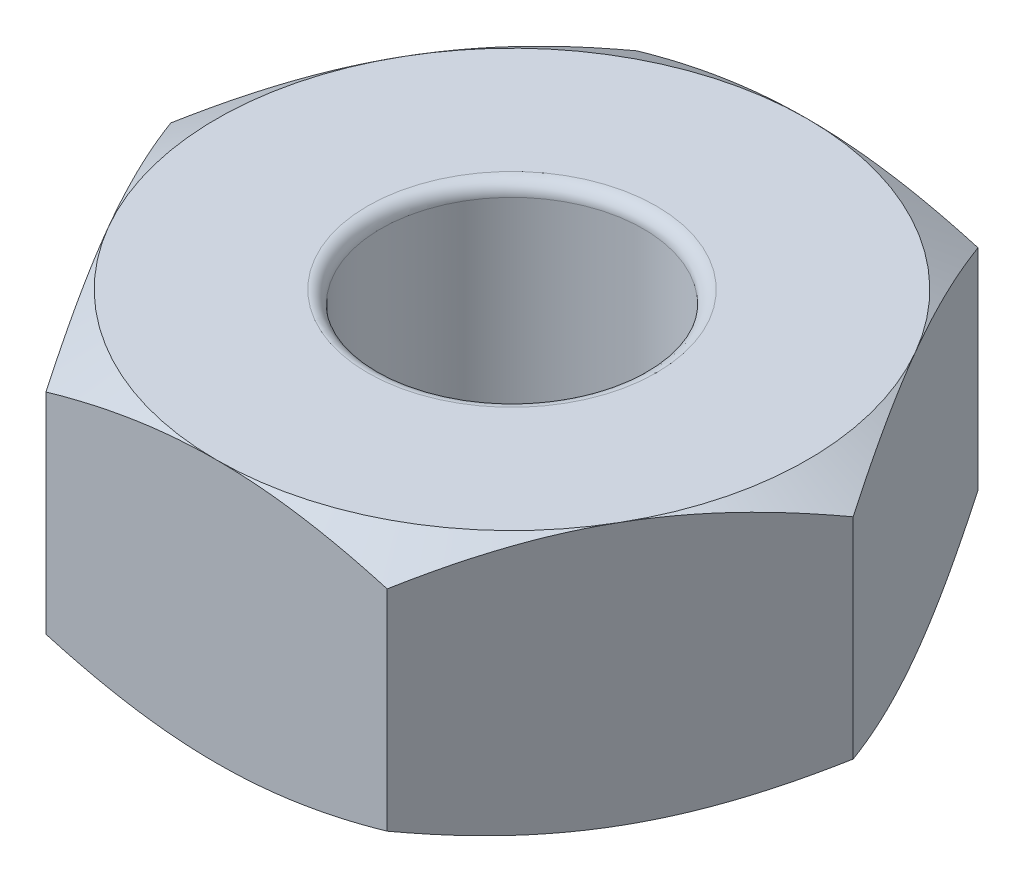
ISO-10303-21;
HEADER;
FILE_DESCRIPTION(('STEP AP214'),'2;1');
FILE_NAME('part.step','',(''),(''),'','','');
FILE_SCHEMA(('AUTOMOTIVE_DESIGN { 1 0 10303 214 1 1 1 1 }'));
ENDSEC;
DATA;
#1=APPLICATION_CONTEXT('core data for automotive mechanical design processes');
#2=APPLICATION_PROTOCOL_DEFINITION('international standard','automotive_design',2000,#1);
#3=PRODUCT_CONTEXT('',#1,'mechanical');
#4=PRODUCT('Part','Part','',(#3));
#5=PRODUCT_RELATED_PRODUCT_CATEGORY('part','',(#4));
#6=PRODUCT_DEFINITION_FORMATION('','',#4);
#7=PRODUCT_DEFINITION_CONTEXT('part definition',#1,'design');
#8=PRODUCT_DEFINITION('design','',#6,#7);
#9=PRODUCT_DEFINITION_SHAPE('','',#8);
#10=(LENGTH_UNIT() NAMED_UNIT(*) SI_UNIT(.MILLI.,.METRE.));
#11=(NAMED_UNIT(*) PLANE_ANGLE_UNIT() SI_UNIT($,.RADIAN.));
#12=(NAMED_UNIT(*) SI_UNIT($,.STERADIAN.) SOLID_ANGLE_UNIT());
#13=UNCERTAINTY_MEASURE_WITH_UNIT(LENGTH_MEASURE(1.E-05),#10,'distance_accuracy_value','');
#14=(GEOMETRIC_REPRESENTATION_CONTEXT(3) GLOBAL_UNCERTAINTY_ASSIGNED_CONTEXT((#13)) GLOBAL_UNIT_ASSIGNED_CONTEXT((#10,
#11,#12)) REPRESENTATION_CONTEXT('',''));
#15=CARTESIAN_POINT('',(0.,0.,0.));
#16=DIRECTION('',(0.,0.,1.));
#17=DIRECTION('',(1.,0.,0.));
#18=AXIS2_PLACEMENT_3D('',#15,#16,#17);
#19=CARTESIAN_POINT('',(0.,2.,0.));
#20=DIRECTION('',(0.,1.,0.));
#21=DIRECTION('',(0.,0.,1.));
#22=AXIS2_PLACEMENT_3D('',#19,#20,#21);
#23=PLANE('',#22);
#24=CARTESIAN_POINT('',(0.,2.,0.));
#25=DIRECTION('',(0.,1.,0.));
#26=DIRECTION('',(0.,0.,1.));
#27=AXIS2_PLACEMENT_3D('',#24,#25,#26);
#28=CIRCLE('',#27,1.1);
#29=CARTESIAN_POINT('',(0.,2.,1.1));
#30=VERTEX_POINT('',#29);
#31=EDGE_CURVE('E12',#30,#30,#28,.F.);
#32=ORIENTED_EDGE('',*,*,#31,.T.);
#33=EDGE_LOOP('',(#32));
#34=FACE_BOUND('',#33,.T.);
#35=CARTESIAN_POINT('',(0.,2.,0.));
#36=DIRECTION('',(0.,1.,0.));
#37=DIRECTION('',(0.,0.,1.));
#38=AXIS2_PLACEMENT_3D('',#35,#36,#37);
#39=CIRCLE('',#38,2.25);
#40=CARTESIAN_POINT('',(-1.94855715851499,2.,1.125));
#41=VERTEX_POINT('',#40);
#42=CARTESIAN_POINT('',(0.,2.,2.25));
#43=VERTEX_POINT('',#42);
#44=EDGE_CURVE('E165',#41,#43,#39,.T.);
#45=ORIENTED_EDGE('',*,*,#44,.T.);
#46=CARTESIAN_POINT('',(1.94855715851499,2.,1.125));
#47=VERTEX_POINT('',#46);
#48=EDGE_CURVE('E144',#43,#47,#39,.T.);
#49=ORIENTED_EDGE('',*,*,#48,.T.);
#50=CARTESIAN_POINT('',(1.94855715851499,2.,-1.125));
#51=VERTEX_POINT('',#50);
#52=EDGE_CURVE('E133',#47,#51,#39,.T.);
#53=ORIENTED_EDGE('',*,*,#52,.T.);
#54=CARTESIAN_POINT('',(0.,2.,-2.25));
#55=VERTEX_POINT('',#54);
#56=EDGE_CURVE('E59',#51,#55,#39,.T.);
#57=ORIENTED_EDGE('',*,*,#56,.T.);
#58=CARTESIAN_POINT('',(-1.94855715851499,2.,-1.125));
#59=VERTEX_POINT('',#58);
#60=EDGE_CURVE('E67',#55,#59,#39,.T.);
#61=ORIENTED_EDGE('',*,*,#60,.T.);
#62=EDGE_CURVE('E172',#59,#41,#39,.T.);
#63=ORIENTED_EDGE('',*,*,#62,.T.);
#64=EDGE_LOOP('',(#45,#49,#53,#57,#61,#63));
#65=FACE_BOUND('',#64,.T.);
#66=ADVANCED_FACE('F43',(#34,#65),#23,.T.);
#67=CARTESIAN_POINT('',(1.29903810567666,2.,2.25));
#68=DIRECTION('',(-0.866025403784439,0.,-0.5));
#69=DIRECTION('',(-0.5,0.,0.866025403784439));
#70=AXIS2_PLACEMENT_3D('',#67,#68,#69);
#71=PLANE('',#70);
#72=CARTESIAN_POINT('',(1.29892263562282,1.79897143456575,2.2502));
#73=CARTESIAN_POINT('',(1.35600944184252,1.83194442195214,2.15132275118564));
#74=CARTESIAN_POINT('',(1.41358901625738,1.8619324645844,2.05159200282091));
#75=CARTESIAN_POINT('',(1.52974527574028,1.91427761176912,1.85040345977937));
#76=CARTESIAN_POINT('',(1.58832402518513,1.93661619729352,1.74894208949705));
#77=CARTESIAN_POINT('',(1.7047555284741,1.97139044232658,1.54727681019892));
#78=CARTESIAN_POINT('',(1.76259036492223,1.98405752616628,1.44710393502333));
#79=CARTESIAN_POINT('',(1.87853225689702,1.99918109258258,1.24628668739732));
#80=CARTESIAN_POINT('',(1.93663889083104,2.001650096976,1.1456430451668));
#81=CARTESIAN_POINT('',(2.04522012232352,1.99652162536397,0.957574835473435));
#82=CARTESIAN_POINT('',(2.09571095029608,1.99018336548488,0.870122156108742));
#83=CARTESIAN_POINT('',(2.19636364908279,1.97009234281011,0.695786567891226));
#84=CARTESIAN_POINT('',(2.24652517159694,1.95633271276892,0.608904262311712));
#85=CARTESIAN_POINT('',(2.34738550181938,1.92193373464933,0.434209045898264));
#86=CARTESIAN_POINT('',(2.39807153998286,1.90114852841735,0.346418252564746));
#87=CARTESIAN_POINT('',(2.49868751999961,1.85397391263702,0.172146263122405));
#88=CARTESIAN_POINT('',(2.54861875151746,1.8275955919857,0.0856628332489973));
#89=CARTESIAN_POINT('',(2.59819168140715,1.79897143456575,-0.000200000000000289));
#90=B_SPLINE_CURVE_WITH_KNOTS('',3,(#72,#73,#74,#75,#76,#77,#78,#79,#80,#81,#82,#83,#84,#85,#86,
#87,#88,#89),.UNSPECIFIED.,.F.,.F.,(4,2,2,2,2,2,2,2,4),(0.,0.356658826016552,0.714175103224236,
1.06284241804968,1.41108149062516,1.71433394539794,2.01786749258222,2.32813511279245,
2.63779325460359),.UNSPECIFIED.);
#91=CARTESIAN_POINT('',(1.29903810567666,1.79903810567666,2.25));
#92=VERTEX_POINT('',#91);
#93=EDGE_CURVE('E149',#92,#47,#90,.T.);
#94=ORIENTED_EDGE('',*,*,#93,.F.);
#95=DIRECTION('',(0.,-1.,0.));
#96=VECTOR('',#95,1.);
#97=CARTESIAN_POINT('',(1.29903810567666,2.,2.25));
#98=LINE('',#97,#96);
#99=CARTESIAN_POINT('',(1.29903810567666,0.200961894323341,2.25));
#100=VERTEX_POINT('',#99);
#101=EDGE_CURVE('E573',#92,#100,#98,.T.);
#102=ORIENTED_EDGE('',*,*,#101,.T.);
#103=CARTESIAN_POINT('',(1.29892263562282,0.201028565434255,2.2502));
#104=CARTESIAN_POINT('',(1.35600944184252,0.168055578047864,2.15132275118564));
#105=CARTESIAN_POINT('',(1.41358901625738,0.138067535415598,2.05159200282091));
#106=CARTESIAN_POINT('',(1.52974527574028,0.0857223882308781,1.85040345977937));
#107=CARTESIAN_POINT('',(1.58832402518513,0.0633838027064787,1.74894208949705));
#108=CARTESIAN_POINT('',(1.7047555284741,0.0286095576734188,1.54727681019892));
#109=CARTESIAN_POINT('',(1.76259036492223,0.0159424738337182,1.44710393502333));
#110=CARTESIAN_POINT('',(1.87853225689702,0.000818907417418814,1.24628668739732));
#111=CARTESIAN_POINT('',(1.93663889083104,-0.00165009697600149,1.1456430451668));
#112=CARTESIAN_POINT('',(2.04522012232352,0.0034783746360293,0.957574835473435));
#113=CARTESIAN_POINT('',(2.09571095029608,0.00981663451512026,0.870122156108742));
#114=CARTESIAN_POINT('',(2.19636364908279,0.0299076571898889,0.695786567891226));
#115=CARTESIAN_POINT('',(2.24652517159694,0.0436672872310835,0.608904262311712));
#116=CARTESIAN_POINT('',(2.34738550181938,0.0780662653506652,0.434209045898264));
#117=CARTESIAN_POINT('',(2.39807153998286,0.0988514715826551,0.346418252564746));
#118=CARTESIAN_POINT('',(2.49868751999961,0.146026087362979,0.172146263122404));
#119=CARTESIAN_POINT('',(2.54861875151746,0.172404408014301,0.0856628332489969));
#120=CARTESIAN_POINT('',(2.59819168140715,0.201028565434254,-0.000200000000000394));
#121=B_SPLINE_CURVE_WITH_KNOTS('',3,(#103,#104,#105,#106,#107,#108,#109,#110,#111,#112,#113,
#114,#115,#116,#117,#118,#119,#120),.UNSPECIFIED.,.F.,.F.,(4,2,2,2,2,2,2,2,4),(0.,
0.356658826016552,0.714175103224236,1.06284241804968,1.41108149062516,1.71433394539794,
2.01786749258222,2.32813511279245,2.63779325460359),.UNSPECIFIED.);
#122=CARTESIAN_POINT('',(1.94855715851499,0.,1.125));
#123=VERTEX_POINT('',#122);
#124=EDGE_CURVE('E359',#100,#123,#121,.T.);
#125=ORIENTED_EDGE('',*,*,#124,.T.);
#126=CARTESIAN_POINT('',(2.59807621135332,0.200961894323341,0.));
#127=VERTEX_POINT('',#126);
#128=EDGE_CURVE('E578',#123,#127,#121,.T.);
#129=ORIENTED_EDGE('',*,*,#128,.T.);
#130=DIRECTION('',(0.,-1.,0.));
#131=VECTOR('',#130,1.);
#132=CARTESIAN_POINT('',(2.59807621135332,2.,0.));
#133=LINE('',#132,#131);
#134=CARTESIAN_POINT('',(2.59807621135332,1.79903810567666,0.));
#135=VERTEX_POINT('',#134);
#136=EDGE_CURVE('E161',#135,#127,#133,.T.);
#137=ORIENTED_EDGE('',*,*,#136,.F.);
#138=EDGE_CURVE('E137',#47,#135,#90,.T.);
#139=ORIENTED_EDGE('',*,*,#138,.F.);
#140=EDGE_LOOP('',(#94,#102,#125,#129,#137,#139));
#141=FACE_BOUND('',#140,.T.);
#142=ADVANCED_FACE('F159',(#141),#71,.F.);
#143=CARTESIAN_POINT('',(2.59807621135332,2.,0.));
#144=DIRECTION('',(-0.866025403784439,0.,0.5));
#145=DIRECTION('',(0.5,0.,0.866025403784439));
#146=AXIS2_PLACEMENT_3D('',#143,#144,#145);
#147=PLANE('',#146);
#148=CARTESIAN_POINT('',(2.59819168140715,1.79897143456575,0.00019999999999966));
#149=CARTESIAN_POINT('',(2.54110487518745,1.83194442195214,-0.0986772488143577));
#150=CARTESIAN_POINT('',(2.48352530077259,1.8619324645844,-0.198407997179094));
#151=CARTESIAN_POINT('',(2.36736904128969,1.91427761176912,-0.399596540220633));
#152=CARTESIAN_POINT('',(2.30879029184485,1.93661619729352,-0.501057910502945));
#153=CARTESIAN_POINT('',(2.19235878855587,1.97139044232658,-0.702723189801079));
#154=CARTESIAN_POINT('',(2.13452395210774,1.98405752616628,-0.802896064976672));
#155=CARTESIAN_POINT('',(2.01858206013295,1.99918109258258,-1.00371331260268));
#156=CARTESIAN_POINT('',(1.96047542619893,2.001650096976,-1.1043569548332));
#157=CARTESIAN_POINT('',(1.85189419470646,1.99652162536397,-1.29242516452656));
#158=CARTESIAN_POINT('',(1.8014033667339,1.99018336548488,-1.37987784389126));
#159=CARTESIAN_POINT('',(1.70075066794718,1.97009234281011,-1.55421343210877));
#160=CARTESIAN_POINT('',(1.65058914543304,1.95633271276892,-1.64109573768829));
#161=CARTESIAN_POINT('',(1.54972881521059,1.92193373464933,-1.81579095410174));
#162=CARTESIAN_POINT('',(1.49904277704711,1.90114852841734,-1.90358174743525));
#163=CARTESIAN_POINT('',(1.39842679703037,1.85397391263702,-2.0778537368776));
#164=CARTESIAN_POINT('',(1.34849556551251,1.8275955919857,-2.164337166751));
#165=CARTESIAN_POINT('',(1.29892263562282,1.79897143456575,-2.2502));
#166=B_SPLINE_CURVE_WITH_KNOTS('',3,(#148,#149,#150,#151,#152,#153,#154,#155,#156,#157,#158,
#159,#160,#161,#162,#163,#164,#165),.UNSPECIFIED.,.F.,.F.,(4,2,2,2,2,2,2,2,4),(0.,
0.356658826016552,0.714175103224236,1.06284241804968,1.41108149062516,1.71433394539794,
2.01786749258222,2.32813511279245,2.63779325460359),.UNSPECIFIED.);
#167=EDGE_CURVE('E139',#135,#51,#166,.T.);
#168=ORIENTED_EDGE('',*,*,#167,.F.);
#169=ORIENTED_EDGE('',*,*,#136,.T.);
#170=CARTESIAN_POINT('',(2.59819168140715,0.201028565434254,0.000199999999999667));
#171=CARTESIAN_POINT('',(2.54110487518745,0.168055578047863,-0.0986772488143577));
#172=CARTESIAN_POINT('',(2.48352530077259,0.138067535415598,-0.198407997179094));
#173=CARTESIAN_POINT('',(2.36736904128969,0.0857223882308777,-0.399596540220633));
#174=CARTESIAN_POINT('',(2.30879029184485,0.0633838027064784,-0.501057910502945));
#175=CARTESIAN_POINT('',(2.19235878855587,0.0286095576734186,-0.702723189801079));
#176=CARTESIAN_POINT('',(2.13452395210774,0.015942473833718,-0.802896064976672));
#177=CARTESIAN_POINT('',(2.01858206013295,0.000818907417418488,-1.00371331260268));
#178=CARTESIAN_POINT('',(1.96047542619893,-0.00165009697600185,-1.1043569548332));
#179=CARTESIAN_POINT('',(1.85189419470646,0.00347837463602903,-1.29242516452657));
#180=CARTESIAN_POINT('',(1.8014033667339,0.00981663451512008,-1.37987784389126));
#181=CARTESIAN_POINT('',(1.70075066794718,0.0299076571898889,-1.55421343210877));
#182=CARTESIAN_POINT('',(1.65058914543303,0.0436672872310834,-1.64109573768829));
#183=CARTESIAN_POINT('',(1.54972881521059,0.0780662653506653,-1.81579095410174));
#184=CARTESIAN_POINT('',(1.49904277704711,0.0988514715826553,-1.90358174743525));
#185=CARTESIAN_POINT('',(1.39842679703037,0.146026087362979,-2.0778537368776));
#186=CARTESIAN_POINT('',(1.34849556551251,0.172404408014302,-2.164337166751));
#187=CARTESIAN_POINT('',(1.29892263562282,0.201028565434254,-2.2502));
#188=B_SPLINE_CURVE_WITH_KNOTS('',3,(#170,#171,#172,#173,#174,#175,#176,#177,#178,#179,#180,
#181,#182,#183,#184,#185,#186,#187),.UNSPECIFIED.,.F.,.F.,(4,2,2,2,2,2,2,2,4),(0.,
0.356658826016552,0.714175103224236,1.06284241804968,1.41108149062516,1.71433394539794,
2.01786749258222,2.32813511279245,2.63779325460359),.UNSPECIFIED.);
#189=CARTESIAN_POINT('',(1.94855715851499,0.,-1.125));
#190=VERTEX_POINT('',#189);
#191=EDGE_CURVE('E584',#127,#190,#188,.T.);
#192=ORIENTED_EDGE('',*,*,#191,.T.);
#193=CARTESIAN_POINT('',(1.29903810567666,0.200961894323341,-2.25));
#194=VERTEX_POINT('',#193);
#195=EDGE_CURVE('E296',#190,#194,#188,.T.);
#196=ORIENTED_EDGE('',*,*,#195,.T.);
#197=DIRECTION('',(0.,-1.,0.));
#198=VECTOR('',#197,1.);
#199=CARTESIAN_POINT('',(1.29903810567666,2.,-2.25));
#200=LINE('',#199,#198);
#201=CARTESIAN_POINT('',(1.29903810567666,1.79903810567666,-2.25));
#202=VERTEX_POINT('',#201);
#203=EDGE_CURVE('E333',#202,#194,#200,.T.);
#204=ORIENTED_EDGE('',*,*,#203,.F.);
#205=EDGE_CURVE('E314',#51,#202,#166,.T.);
#206=ORIENTED_EDGE('',*,*,#205,.F.);
#207=EDGE_LOOP('',(#168,#169,#192,#196,#204,#206));
#208=FACE_BOUND('',#207,.T.);
#209=ADVANCED_FACE('F306',(#208),#147,.F.);
#210=CARTESIAN_POINT('',(1.29903810567666,2.,-2.25));
#211=DIRECTION('',(0.,0.,1.));
#212=DIRECTION('',(1.,0.,0.));
#213=AXIS2_PLACEMENT_3D('',#210,#211,#212);
#214=PLANE('',#213);
#215=CARTESIAN_POINT('',(-3.55058679430433,0.872163120303613,-2.25));
#216=CARTESIAN_POINT('',(-3.45177273475324,0.920339741130212,-2.25));
#217=CARTESIAN_POINT('',(-3.35273828586176,0.968071758065726,-2.25));
#218=CARTESIAN_POINT('',(-3.15411160974005,1.06239765661445,-2.25));
#219=CARTESIAN_POINT('',(-3.05451930272816,1.10899137004664,-2.25));
#220=CARTESIAN_POINT('',(-2.85417566776101,1.2010131590937,-2.25));
#221=CARTESIAN_POINT('',(-2.75342101411128,1.2464340182172,-2.25));
#222=CARTESIAN_POINT('',(-2.55113133537904,1.33549662686598,-2.25));
#223=CARTESIAN_POINT('',(-2.44959634572291,1.37913845659674,-2.25));
#224=CARTESIAN_POINT('',(-2.24210504949879,1.46562561978877,-2.25));
#225=CARTESIAN_POINT('',(-2.13611607607433,1.50839299412517,-2.25));
#226=CARTESIAN_POINT('',(-1.92292097124666,1.59083665725312,-2.25));
#227=CARTESIAN_POINT('',(-1.8157147081738,1.63051260793652,-2.25));
#228=CARTESIAN_POINT('',(-1.60009599414757,1.7057766325813,-2.25));
#229=CARTESIAN_POINT('',(-1.49168628096479,1.74137247383476,-2.25));
#230=CARTESIAN_POINT('',(-1.2733129172305,1.80737481886539,-2.25));
#231=CARTESIAN_POINT('',(-1.16334974796475,1.83778289330642,-2.25));
#232=CARTESIAN_POINT('',(-0.942417271021545,1.89182948632855,-2.25));
#233=CARTESIAN_POINT('',(-0.831457467717297,1.91550615987864,-2.25));
#234=CARTESIAN_POINT('',(-0.608096189896043,1.9547922793066,-2.25));
#235=CARTESIAN_POINT('',(-0.495694875422072,1.97040261293415,-2.25));
#236=CARTESIAN_POINT('',(-0.271504459309459,1.99210964429452,-2.25));
#237=CARTESIAN_POINT('',(-0.159727970455801,1.99833339294579,-2.25));
#238=CARTESIAN_POINT('',(0.0639565850584433,2.00107827942084,-2.25));
#239=CARTESIAN_POINT('',(0.175864653427297,1.99759928985414,-2.25));
#240=CARTESIAN_POINT('',(0.364058166596142,1.98384132338946,-2.25));
#241=CARTESIAN_POINT('',(0.44053663738807,1.97602983648694,-2.25));
#242=CARTESIAN_POINT('',(0.592971566651748,1.95632951016093,-2.25));
#243=CARTESIAN_POINT('',(0.668927959585447,1.94444016803395,-2.25));
#244=CARTESIAN_POINT('',(0.895879287466665,1.90327466424577,-2.25));
#245=CARTESIAN_POINT('',(1.04588272294361,1.86850715394146,-2.25));
#246=CARTESIAN_POINT('',(1.34634180161594,1.78719334623677,-2.25));
#247=CARTESIAN_POINT('',(1.4967247534889,1.74038871289907,-2.25));
#248=CARTESIAN_POINT('',(1.72019995238336,1.6642083641808,-2.25));
#249=CARTESIAN_POINT('',(1.79433662204237,1.6378214346756,-2.25));
#250=CARTESIAN_POINT('',(1.94198875717588,1.58336630062394,-2.25));
#251=CARTESIAN_POINT('',(2.01550423746144,1.55529813629311,-2.25));
#252=CARTESIAN_POINT('',(2.2152120190323,1.47685501232471,-2.25));
#253=CARTESIAN_POINT('',(2.34085855241701,1.42509333026193,-2.25));
#254=CARTESIAN_POINT('',(2.59083781240068,1.31847776641583,-2.25));
#255=CARTESIAN_POINT('',(2.71517038839134,1.26362353462698,-2.25));
#256=CARTESIAN_POINT('',(2.96282354133787,1.15156631023509,-2.25));
#257=CARTESIAN_POINT('',(3.08614373244744,1.09436246784655,-2.25));
#258=CARTESIAN_POINT('',(3.33193936233926,0.978164398851541,-2.25));
#259=CARTESIAN_POINT('',(3.45441477444763,0.919170116026668,-2.25));
#260=CARTESIAN_POINT('',(3.82122369211898,0.739927593852892,-2.25));
#261=CARTESIAN_POINT('',(4.06454136639539,0.617603385559989,-2.25));
#262=CARTESIAN_POINT('',(4.54933134803543,0.369507279531416,-2.25));
#263=CARTESIAN_POINT('',(4.79080404694706,0.243736140859006,-2.25));
#264=CARTESIAN_POINT('',(5.24659837447223,0.00350470326548644,-2.25));
#265=CARTESIAN_POINT('',(5.46104611584601,-0.110716729235028,-2.25));
#266=CARTESIAN_POINT('',(5.88922521275442,-0.340525211637994,-2.25));
#267=CARTESIAN_POINT('',(6.10295652118252,-0.456112349161159,-2.25));
#268=CARTESIAN_POINT('',(6.52913420606204,-0.687898070390892,-2.25));
#269=CARTESIAN_POINT('',(6.74158247330175,-0.804093181646634,-2.25));
#270=CARTESIAN_POINT('',(7.1660318531166,-1.03725665841206,-2.25));
#271=CARTESIAN_POINT('',(7.3780330007839,-1.15422496001412,-2.25));
#272=CARTESIAN_POINT('',(7.58987767740365,-1.27147401580928,-2.25));
#273=B_SPLINE_CURVE_WITH_KNOTS('',3,(#215,#216,#217,#218,#219,#220,#221,#222,#223,#224,#225,
#226,#227,#228,#229,#230,#231,#232,#233,#234,#235,#236,#237,#238,#239,#240,#241,#242,#243,#244,
#245,#246,#247,#248,#249,#250,#251,#252,#253,#254,#255,#256,#257,#258,#259,#260,#261,#262,#263,
#264,#265,#266,#267,#268,#269,#270,#271,#272),.UNSPECIFIED.,.F.,.F.,(4,2,2,2,2,2,2,2,2,2,2,2,2,
2,2,2,2,2,2,2,2,2,2,2,2,2,2,2,4),(0.,0.329801936345895,0.659652308832364,0.991196933952322,
1.32272659519935,1.66556593785109,2.00844272426603,2.35065553807217,2.6927645579182,
3.03289390500186,3.37298581080914,3.70843178154988,4.04388215649249,4.27440155172861,
4.50494937479647,4.96626568613451,5.43845635297785,5.67451815109488,5.91057430479936,
6.31818558648903,6.72584309337671,7.13364935919031,7.54146844307023,8.35842269894229,
9.17519847292406,9.90410137248985,10.6330512936207,11.35949297206,12.0858753394877),.UNSPECIFIED.);
#274=EDGE_CURVE('E320',#202,#55,#273,.F.);
#275=ORIENTED_EDGE('',*,*,#274,.F.);
#276=ORIENTED_EDGE('',*,*,#203,.T.);
#277=CARTESIAN_POINT('',(-3.55058679430434,1.12783687969639,-2.25));
#278=CARTESIAN_POINT('',(-3.45177273475324,1.07966025886979,-2.25));
#279=CARTESIAN_POINT('',(-3.35273828586176,1.03192824193427,-2.25));
#280=CARTESIAN_POINT('',(-3.15411160974005,0.937602343385551,-2.25));
#281=CARTESIAN_POINT('',(-3.05451930272816,0.891008629953362,-2.25));
#282=CARTESIAN_POINT('',(-2.85417566776101,0.798986840906296,-2.25));
#283=CARTESIAN_POINT('',(-2.75342101411128,0.753565981782802,-2.25));
#284=CARTESIAN_POINT('',(-2.55113133537904,0.664503373134022,-2.25));
#285=CARTESIAN_POINT('',(-2.44959634572291,0.620861543403261,-2.25));
#286=CARTESIAN_POINT('',(-2.24210504949879,0.534374380211228,-2.25));
#287=CARTESIAN_POINT('',(-2.13611607607433,0.491607005874827,-2.25));
#288=CARTESIAN_POINT('',(-1.92292097124666,0.409163342746883,-2.25));
#289=CARTESIAN_POINT('',(-1.8157147081738,0.369487392063478,-2.25));
#290=CARTESIAN_POINT('',(-1.60009599414757,0.294223367418695,-2.25));
#291=CARTESIAN_POINT('',(-1.4916862809648,0.258627526165239,-2.25));
#292=CARTESIAN_POINT('',(-1.2733129172305,0.192625181134606,-2.25));
#293=CARTESIAN_POINT('',(-1.16334974796475,0.16221710669358,-2.25));
#294=CARTESIAN_POINT('',(-0.942417271021545,0.108170513671451,-2.25));
#295=CARTESIAN_POINT('',(-0.831457467717297,0.084493840121362,-2.25));
#296=CARTESIAN_POINT('',(-0.608096189896043,0.0452077206933979,-2.25));
#297=CARTESIAN_POINT('',(-0.495694875422072,0.0295973870658483,-2.25));
#298=CARTESIAN_POINT('',(-0.27150445930946,0.00789035570548405,-2.25));
#299=CARTESIAN_POINT('',(-0.159727970455801,0.00166660705420525,-2.25));
#300=CARTESIAN_POINT('',(0.0639565850584433,-0.00107827942083766,-2.25));
#301=CARTESIAN_POINT('',(0.175864653427297,0.00240071014585843,-2.25));
#302=CARTESIAN_POINT('',(0.364058166596142,0.0161586766105357,-2.25));
#303=CARTESIAN_POINT('',(0.44053663738807,0.0239701635130599,-2.25));
#304=CARTESIAN_POINT('',(0.592971566651748,0.0436704898390692,-2.25));
#305=CARTESIAN_POINT('',(0.668927959585447,0.0555598319660524,-2.25));
#306=CARTESIAN_POINT('',(0.895879287466665,0.0967253357542302,-2.25));
#307=CARTESIAN_POINT('',(1.04588272294361,0.13149284605854,-2.25));
#308=CARTESIAN_POINT('',(1.34634180161594,0.212806653763226,-2.25));
#309=CARTESIAN_POINT('',(1.4967247534889,0.259611287100926,-2.25));
#310=CARTESIAN_POINT('',(1.72019995238336,0.335791635819199,-2.25));
#311=CARTESIAN_POINT('',(1.79433662204237,0.3621785653244,-2.25));
#312=CARTESIAN_POINT('',(1.94198875717588,0.416633699376056,-2.25));
#313=CARTESIAN_POINT('',(2.01550423746144,0.444701863706892,-2.25));
#314=CARTESIAN_POINT('',(2.2152120190323,0.523144987675288,-2.25));
#315=CARTESIAN_POINT('',(2.34085855241701,0.574906669738069,-2.25));
#316=CARTESIAN_POINT('',(2.59083781240068,0.681522233584174,-2.25));
#317=CARTESIAN_POINT('',(2.71517038839134,0.736376465373024,-2.25));
#318=CARTESIAN_POINT('',(2.96282354133787,0.848433689764913,-2.25));
#319=CARTESIAN_POINT('',(3.08614373244744,0.90563753215345,-2.25));
#320=CARTESIAN_POINT('',(3.33193936233926,1.02183560114846,-2.25));
#321=CARTESIAN_POINT('',(3.45441477444763,1.08082988397333,-2.25));
#322=CARTESIAN_POINT('',(3.82122369211898,1.26007240614711,-2.25));
#323=CARTESIAN_POINT('',(4.06454136639539,1.38239661444001,-2.25));
#324=CARTESIAN_POINT('',(4.54933134803543,1.63049272046858,-2.25));
#325=CARTESIAN_POINT('',(4.79080404694706,1.75626385914099,-2.25));
#326=CARTESIAN_POINT('',(5.24659837447223,1.99649529673452,-2.25));
#327=CARTESIAN_POINT('',(5.46104611584601,2.11071672923503,-2.25));
#328=CARTESIAN_POINT('',(5.88922521275442,2.340525211638,-2.25));
#329=CARTESIAN_POINT('',(6.10295652118253,2.45611234916116,-2.25));
#330=CARTESIAN_POINT('',(6.52913420606204,2.68789807039089,-2.25));
#331=CARTESIAN_POINT('',(6.74158247330175,2.80409318164664,-2.25));
#332=CARTESIAN_POINT('',(7.1660318531166,3.03725665841206,-2.25));
#333=CARTESIAN_POINT('',(7.3780330007839,3.15422496001412,-2.25));
#334=CARTESIAN_POINT('',(7.58987767740365,3.27147401580928,-2.25));
#335=B_SPLINE_CURVE_WITH_KNOTS('',3,(#277,#278,#279,#280,#281,#282,#283,#284,#285,#286,#287,
#288,#289,#290,#291,#292,#293,#294,#295,#296,#297,#298,#299,#300,#301,#302,#303,#304,#305,#306,
#307,#308,#309,#310,#311,#312,#313,#314,#315,#316,#317,#318,#319,#320,#321,#322,#323,#324,#325,
#326,#327,#328,#329,#330,#331,#332,#333,#334),.UNSPECIFIED.,.F.,.F.,(4,2,2,2,2,2,2,2,2,2,2,2,2,
2,2,2,2,2,2,2,2,2,2,2,2,2,2,2,4),(0.,0.329801936345895,0.659652308832365,0.991196933952322,
1.32272659519935,1.66556593785109,2.00844272426603,2.35065553807217,2.6927645579182,
3.03289390500186,3.37298581080915,3.70843178154988,4.04388215649249,4.27440155172861,
4.50494937479648,4.96626568613451,5.43845635297785,5.67451815109488,5.91057430479936,
6.31818558648903,6.72584309337671,7.13364935919031,7.54146844307024,8.35842269894229,
9.17519847292406,9.90410137248986,10.6330512936207,11.35949297206,12.0858753394877),.UNSPECIFIED.);
#336=CARTESIAN_POINT('',(0.,0.,-2.25));
#337=VERTEX_POINT('',#336);
#338=EDGE_CURVE('E295',#194,#337,#335,.F.);
#339=ORIENTED_EDGE('',*,*,#338,.T.);
#340=CARTESIAN_POINT('',(-1.29903810567666,0.200961894323341,-2.25));
#341=VERTEX_POINT('',#340);
#342=EDGE_CURVE('E287',#337,#341,#335,.F.);
#343=ORIENTED_EDGE('',*,*,#342,.T.);
#344=DIRECTION('',(0.,-1.,0.));
#345=VECTOR('',#344,1.);
#346=CARTESIAN_POINT('',(-1.29903810567666,2.,-2.25));
#347=LINE('',#346,#345);
#348=CARTESIAN_POINT('',(-1.29903810567666,1.79903810567666,-2.25));
#349=VERTEX_POINT('',#348);
#350=EDGE_CURVE('E327',#349,#341,#347,.T.);
#351=ORIENTED_EDGE('',*,*,#350,.F.);
#352=EDGE_CURVE('E187',#55,#349,#273,.F.);
#353=ORIENTED_EDGE('',*,*,#352,.F.);
#354=EDGE_LOOP('',(#275,#276,#339,#343,#351,#353));
#355=FACE_BOUND('',#354,.T.);
#356=ADVANCED_FACE('F303',(#355),#214,.F.);
#357=CARTESIAN_POINT('',(-1.29903810567666,2.,-2.25));
#358=DIRECTION('',(0.866025403784439,0.,0.5));
#359=DIRECTION('',(0.5,0.,-0.866025403784439));
#360=AXIS2_PLACEMENT_3D('',#357,#358,#359);
#361=PLANE('',#360);
#362=CARTESIAN_POINT('',(-1.29892263562282,1.79897143456575,-2.2502));
#363=CARTESIAN_POINT('',(-1.35600944184252,1.83194442195214,-2.15132275118564));
#364=CARTESIAN_POINT('',(-1.41358901625738,1.8619324645844,-2.05159200282091));
#365=CARTESIAN_POINT('',(-1.52974527574028,1.91427761176912,-1.85040345977937));
#366=CARTESIAN_POINT('',(-1.58832402518512,1.93661619729352,-1.74894208949705));
#367=CARTESIAN_POINT('',(-1.7047555284741,1.97139044232658,-1.54727681019892));
#368=CARTESIAN_POINT('',(-1.76259036492223,1.98405752616628,-1.44710393502333));
#369=CARTESIAN_POINT('',(-1.87853225689702,1.99918109258258,-1.24628668739732));
#370=CARTESIAN_POINT('',(-1.93663889083104,2.001650096976,-1.1456430451668));
#371=CARTESIAN_POINT('',(-2.04522012232352,1.99652162536397,-0.957574835473435));
#372=CARTESIAN_POINT('',(-2.09571095029608,1.99018336548488,-0.870122156108742));
#373=CARTESIAN_POINT('',(-2.19636364908279,1.97009234281011,-0.695786567891226));
#374=CARTESIAN_POINT('',(-2.24652517159694,1.95633271276892,-0.608904262311712));
#375=CARTESIAN_POINT('',(-2.34738550181938,1.92193373464934,-0.434209045898264));
#376=CARTESIAN_POINT('',(-2.39807153998286,1.90114852841734,-0.346418252564747));
#377=CARTESIAN_POINT('',(-2.49868751999961,1.85397391263702,-0.172146263122405));
#378=CARTESIAN_POINT('',(-2.54861875151746,1.8275955919857,-0.0856628332489973));
#379=CARTESIAN_POINT('',(-2.59819168140715,1.79897143456575,0.000200000000000385));
#380=B_SPLINE_CURVE_WITH_KNOTS('',3,(#362,#363,#364,#365,#366,#367,#368,#369,#370,#371,#372,
#373,#374,#375,#376,#377,#378,#379),.UNSPECIFIED.,.F.,.F.,(4,2,2,2,2,2,2,2,4),(0.,
0.356658826016552,0.714175103224236,1.06284241804968,1.41108149062516,1.71433394539794,
2.01786749258222,2.32813511279245,2.63779325460359),.UNSPECIFIED.);
#381=EDGE_CURVE('E184',#349,#59,#380,.T.);
#382=ORIENTED_EDGE('',*,*,#381,.F.);
#383=ORIENTED_EDGE('',*,*,#350,.T.);
#384=CARTESIAN_POINT('',(-1.29892263562282,0.201028565434255,-2.2502));
#385=CARTESIAN_POINT('',(-1.35600944184252,0.168055578047864,-2.15132275118564));
#386=CARTESIAN_POINT('',(-1.41358901625738,0.138067535415598,-2.05159200282091));
#387=CARTESIAN_POINT('',(-1.52974527574028,0.0857223882308778,-1.85040345977937));
#388=CARTESIAN_POINT('',(-1.58832402518512,0.0633838027064785,-1.74894208949705));
#389=CARTESIAN_POINT('',(-1.7047555284741,0.0286095576734187,-1.54727681019892));
#390=CARTESIAN_POINT('',(-1.76259036492223,0.0159424738337181,-1.44710393502333));
#391=CARTESIAN_POINT('',(-1.87853225689702,0.00081890741741858,-1.24628668739732));
#392=CARTESIAN_POINT('',(-1.93663889083104,-0.00165009697600175,-1.1456430451668));
#393=CARTESIAN_POINT('',(-2.04522012232352,0.00347837463602906,-0.957574835473435));
#394=CARTESIAN_POINT('',(-2.09571095029608,0.00981663451512005,-0.870122156108742));
#395=CARTESIAN_POINT('',(-2.19636364908279,0.0299076571898887,-0.695786567891226));
#396=CARTESIAN_POINT('',(-2.24652517159694,0.0436672872310831,-0.608904262311712));
#397=CARTESIAN_POINT('',(-2.34738550181938,0.078066265350665,-0.434209045898264));
#398=CARTESIAN_POINT('',(-2.39807153998286,0.0988514715826551,-0.346418252564747));
#399=CARTESIAN_POINT('',(-2.49868751999961,0.146026087362979,-0.172146263122405));
#400=CARTESIAN_POINT('',(-2.54861875151746,0.172404408014302,-0.0856628332489974));
#401=CARTESIAN_POINT('',(-2.59819168140715,0.201028565434254,0.000200000000000386));
#402=B_SPLINE_CURVE_WITH_KNOTS('',3,(#384,#385,#386,#387,#388,#389,#390,#391,#392,#393,#394,
#395,#396,#397,#398,#399,#400,#401),.UNSPECIFIED.,.F.,.F.,(4,2,2,2,2,2,2,2,4),(0.,
0.356658826016552,0.714175103224236,1.06284241804968,1.41108149062516,1.71433394539794,
2.01786749258222,2.32813511279245,2.63779325460359),.UNSPECIFIED.);
#403=CARTESIAN_POINT('',(-1.94855715851499,0.,-1.125));
#404=VERTEX_POINT('',#403);
#405=EDGE_CURVE('E286',#341,#404,#402,.T.);
#406=ORIENTED_EDGE('',*,*,#405,.T.);
#407=CARTESIAN_POINT('',(-2.59807621135332,0.200961894323341,0.));
#408=VERTEX_POINT('',#407);
#409=EDGE_CURVE('E279',#404,#408,#402,.T.);
#410=ORIENTED_EDGE('',*,*,#409,.T.);
#411=DIRECTION('',(0.,-1.,0.));
#412=VECTOR('',#411,1.);
#413=CARTESIAN_POINT('',(-2.59807621135332,2.,0.));
#414=LINE('',#413,#412);
#415=CARTESIAN_POINT('',(-2.59807621135332,1.79903810567666,0.));
#416=VERTEX_POINT('',#415);
#417=EDGE_CURVE('E195',#416,#408,#414,.T.);
#418=ORIENTED_EDGE('',*,*,#417,.F.);
#419=EDGE_CURVE('E180',#59,#416,#380,.T.);
#420=ORIENTED_EDGE('',*,*,#419,.F.);
#421=EDGE_LOOP('',(#382,#383,#406,#410,#418,#420));
#422=FACE_BOUND('',#421,.T.);
#423=ADVANCED_FACE('F193',(#422),#361,.F.);
#424=CARTESIAN_POINT('',(-2.59807621135332,2.,0.));
#425=DIRECTION('',(0.866025403784439,0.,-0.5));
#426=DIRECTION('',(-0.5,0.,-0.866025403784439));
#427=AXIS2_PLACEMENT_3D('',#424,#425,#426);
#428=PLANE('',#427);
#429=CARTESIAN_POINT('',(-2.59819168140715,1.79897143456575,-0.000199999999999607));
#430=CARTESIAN_POINT('',(-2.54110487518745,1.83194442195214,0.0986772488143577));
#431=CARTESIAN_POINT('',(-2.48352530077259,1.8619324645844,0.198407997179094));
#432=CARTESIAN_POINT('',(-2.36736904128969,1.91427761176912,0.399596540220633));
#433=CARTESIAN_POINT('',(-2.30879029184485,1.93661619729352,0.501057910502946));
#434=CARTESIAN_POINT('',(-2.19235878855587,1.97139044232658,0.702723189801079));
#435=CARTESIAN_POINT('',(-2.13452395210774,1.98405752616628,0.802896064976672));
#436=CARTESIAN_POINT('',(-2.01858206013295,1.99918109258258,1.00371331260268));
#437=CARTESIAN_POINT('',(-1.96047542619893,2.001650096976,1.1043569548332));
#438=CARTESIAN_POINT('',(-1.85189419470646,1.99652162536397,1.29242516452657));
#439=CARTESIAN_POINT('',(-1.8014033667339,1.99018336548488,1.37987784389126));
#440=CARTESIAN_POINT('',(-1.70075066794718,1.97009234281011,1.55421343210877));
#441=CARTESIAN_POINT('',(-1.65058914543304,1.95633271276892,1.64109573768829));
#442=CARTESIAN_POINT('',(-1.54972881521059,1.92193373464933,1.81579095410174));
#443=CARTESIAN_POINT('',(-1.49904277704711,1.90114852841734,1.90358174743525));
#444=CARTESIAN_POINT('',(-1.39842679703037,1.85397391263702,2.0778537368776));
#445=CARTESIAN_POINT('',(-1.34849556551251,1.8275955919857,2.164337166751));
#446=CARTESIAN_POINT('',(-1.29892263562282,1.79897143456575,2.2502));
#447=B_SPLINE_CURVE_WITH_KNOTS('',3,(#429,#430,#431,#432,#433,#434,#435,#436,#437,#438,#439,
#440,#441,#442,#443,#444,#445,#446),.UNSPECIFIED.,.F.,.F.,(4,2,2,2,2,2,2,2,4),(0.,
0.356658826016552,0.714175103224236,1.06284241804968,1.41108149062516,1.71433394539794,
2.01786749258222,2.32813511279245,2.63779325460359),.UNSPECIFIED.);
#448=EDGE_CURVE('E169',#416,#41,#447,.T.);
#449=ORIENTED_EDGE('',*,*,#448,.F.);
#450=ORIENTED_EDGE('',*,*,#417,.T.);
#451=CARTESIAN_POINT('',(-2.59819168140715,0.201028565434254,-0.000199999999999614));
#452=CARTESIAN_POINT('',(-2.54110487518745,0.168055578047863,0.0986772488143579));
#453=CARTESIAN_POINT('',(-2.48352530077259,0.138067535415597,0.198407997179094));
#454=CARTESIAN_POINT('',(-2.36736904128969,0.0857223882308777,0.399596540220633));
#455=CARTESIAN_POINT('',(-2.30879029184485,0.0633838027064785,0.501057910502946));
#456=CARTESIAN_POINT('',(-2.19235878855587,0.0286095576734187,0.702723189801079));
#457=CARTESIAN_POINT('',(-2.13452395210774,0.0159424738337181,0.802896064976672));
#458=CARTESIAN_POINT('',(-2.01858206013295,0.000818907417418639,1.00371331260268));
#459=CARTESIAN_POINT('',(-1.96047542619893,-0.00165009697600171,1.1043569548332));
#460=CARTESIAN_POINT('',(-1.85189419470646,0.00347837463602925,1.29242516452657));
#461=CARTESIAN_POINT('',(-1.8014033667339,0.00981663451512039,1.37987784389126));
#462=CARTESIAN_POINT('',(-1.70075066794718,0.0299076571898892,1.55421343210877));
#463=CARTESIAN_POINT('',(-1.65058914543304,0.0436672872310837,1.64109573768829));
#464=CARTESIAN_POINT('',(-1.54972881521059,0.0780662653506656,1.81579095410174));
#465=CARTESIAN_POINT('',(-1.49904277704711,0.0988514715826557,1.90358174743525));
#466=CARTESIAN_POINT('',(-1.39842679703037,0.146026087362979,2.0778537368776));
#467=CARTESIAN_POINT('',(-1.34849556551251,0.172404408014302,2.164337166751));
#468=CARTESIAN_POINT('',(-1.29892263562282,0.201028565434255,2.2502));
#469=B_SPLINE_CURVE_WITH_KNOTS('',3,(#451,#452,#453,#454,#455,#456,#457,#458,#459,#460,#461,
#462,#463,#464,#465,#466,#467,#468),.UNSPECIFIED.,.F.,.F.,(4,2,2,2,2,2,2,2,4),(0.,
0.356658826016552,0.714175103224236,1.06284241804968,1.41108149062516,1.71433394539794,
2.01786749258222,2.32813511279245,2.63779325460359),.UNSPECIFIED.);
#470=CARTESIAN_POINT('',(-1.94855715851499,0.,1.125));
#471=VERTEX_POINT('',#470);
#472=EDGE_CURVE('E277',#408,#471,#469,.T.);
#473=ORIENTED_EDGE('',*,*,#472,.T.);
#474=CARTESIAN_POINT('',(-1.29903810567675,0.200961894323284,2.25));
#475=VERTEX_POINT('',#474);
#476=EDGE_CURVE('E269',#471,#475,#469,.T.);
#477=ORIENTED_EDGE('',*,*,#476,.T.);
#478=DIRECTION('',(0.,-1.,0.));
#479=VECTOR('',#478,1.);
#480=CARTESIAN_POINT('',(-1.29903810567666,2.,2.25));
#481=LINE('',#480,#479);
#482=CARTESIAN_POINT('',(-1.29903810567675,1.79903810567672,2.25));
#483=VERTEX_POINT('',#482);
#484=EDGE_CURVE('E338',#483,#475,#481,.T.);
#485=ORIENTED_EDGE('',*,*,#484,.F.);
#486=EDGE_CURVE('E167',#41,#483,#447,.T.);
#487=ORIENTED_EDGE('',*,*,#486,.F.);
#488=EDGE_LOOP('',(#449,#450,#473,#477,#485,#487));
#489=FACE_BOUND('',#488,.T.);
#490=ADVANCED_FACE('F260',(#489),#428,.F.);
#491=CARTESIAN_POINT('',(-1.29903810567666,2.,2.25));
#492=DIRECTION('',(0.,0.,-1.));
#493=DIRECTION('',(-1.,0.,0.));
#494=AXIS2_PLACEMENT_3D('',#491,#492,#493);
#495=PLANE('',#494);
#496=CARTESIAN_POINT('',(-3.55058679430433,0.872163120303613,2.25));
#497=CARTESIAN_POINT('',(-3.45177273475324,0.920339741130212,2.25));
#498=CARTESIAN_POINT('',(-3.35273828586176,0.968071758065726,2.25));
#499=CARTESIAN_POINT('',(-3.15411160974005,1.06239765661445,2.25));
#500=CARTESIAN_POINT('',(-3.05451930272816,1.10899137004664,2.25));
#501=CARTESIAN_POINT('',(-2.85417566776101,1.2010131590937,2.25));
#502=CARTESIAN_POINT('',(-2.75342101411128,1.2464340182172,2.25));
#503=CARTESIAN_POINT('',(-2.55113133537904,1.33549662686598,2.25));
#504=CARTESIAN_POINT('',(-2.44959634572291,1.37913845659674,2.25));
#505=CARTESIAN_POINT('',(-2.24210504949879,1.46562561978877,2.25));
#506=CARTESIAN_POINT('',(-2.13611607607433,1.50839299412517,2.25));
#507=CARTESIAN_POINT('',(-1.92292097124666,1.59083665725312,2.25));
#508=CARTESIAN_POINT('',(-1.81571470817379,1.63051260793652,2.25));
#509=CARTESIAN_POINT('',(-1.60009599414757,1.70577663258131,2.25));
#510=CARTESIAN_POINT('',(-1.49168628096479,1.74137247383476,2.25));
#511=CARTESIAN_POINT('',(-1.2733129172305,1.80737481886539,2.25));
#512=CARTESIAN_POINT('',(-1.16334974796475,1.83778289330642,2.25));
#513=CARTESIAN_POINT('',(-0.942417271021545,1.89182948632855,2.25));
#514=CARTESIAN_POINT('',(-0.831457467717297,1.91550615987864,2.25));
#515=CARTESIAN_POINT('',(-0.608096189896042,1.9547922793066,2.25));
#516=CARTESIAN_POINT('',(-0.495694875422072,1.97040261293415,2.25));
#517=CARTESIAN_POINT('',(-0.271504459309459,1.99210964429452,2.25));
#518=CARTESIAN_POINT('',(-0.159727970455801,1.99833339294579,2.25));
#519=CARTESIAN_POINT('',(0.0639565850584433,2.00107827942084,2.25));
#520=CARTESIAN_POINT('',(0.175864653427297,1.99759928985414,2.25));
#521=CARTESIAN_POINT('',(0.364058166596143,1.98384132338946,2.25));
#522=CARTESIAN_POINT('',(0.44053663738807,1.97602983648694,2.25));
#523=CARTESIAN_POINT('',(0.592971566651749,1.95632951016093,2.25));
#524=CARTESIAN_POINT('',(0.668927959585448,1.94444016803395,2.25));
#525=CARTESIAN_POINT('',(0.895879287466666,1.90327466424577,2.25));
#526=CARTESIAN_POINT('',(1.04588272294361,1.86850715394146,2.25));
#527=CARTESIAN_POINT('',(1.34634180161594,1.78719334623677,2.25));
#528=CARTESIAN_POINT('',(1.4967247534889,1.74038871289907,2.25));
#529=CARTESIAN_POINT('',(1.72019995238336,1.6642083641808,2.25));
#530=CARTESIAN_POINT('',(1.79433662204237,1.6378214346756,2.25));
#531=CARTESIAN_POINT('',(1.94198875717588,1.58336630062394,2.25));
#532=CARTESIAN_POINT('',(2.01550423746144,1.55529813629311,2.25));
#533=CARTESIAN_POINT('',(2.2152120190323,1.47685501232471,2.25));
#534=CARTESIAN_POINT('',(2.34085855241701,1.42509333026193,2.25));
#535=CARTESIAN_POINT('',(2.59083781240068,1.31847776641583,2.25));
#536=CARTESIAN_POINT('',(2.71517038839134,1.26362353462698,2.25));
#537=CARTESIAN_POINT('',(2.96282354133787,1.15156631023509,2.25));
#538=CARTESIAN_POINT('',(3.08614373244744,1.09436246784655,2.25));
#539=CARTESIAN_POINT('',(3.33193936233926,0.97816439885154,2.25));
#540=CARTESIAN_POINT('',(3.45441477444763,0.919170116026667,2.25));
#541=CARTESIAN_POINT('',(3.82122369211898,0.739927593852891,2.25));
#542=CARTESIAN_POINT('',(4.06454136639539,0.617603385559987,2.25));
#543=CARTESIAN_POINT('',(4.54933134803543,0.369507279531415,2.25));
#544=CARTESIAN_POINT('',(4.79080404694706,0.243736140859004,2.25));
#545=CARTESIAN_POINT('',(5.24659837447223,0.00350470326548495,2.25));
#546=CARTESIAN_POINT('',(5.46104611584601,-0.110716729235029,2.25));
#547=CARTESIAN_POINT('',(5.88922521275442,-0.340525211637995,2.25));
#548=CARTESIAN_POINT('',(6.10295652118253,-0.456112349161161,2.25));
#549=CARTESIAN_POINT('',(6.52913420606204,-0.687898070390894,2.25));
#550=CARTESIAN_POINT('',(6.74158247330175,-0.804093181646636,2.25));
#551=CARTESIAN_POINT('',(7.1660318531166,-1.03725665841206,2.25));
#552=CARTESIAN_POINT('',(7.3780330007839,-1.15422496001412,2.25));
#553=CARTESIAN_POINT('',(7.58987767740366,-1.27147401580929,2.25));
#554=B_SPLINE_CURVE_WITH_KNOTS('',3,(#496,#497,#498,#499,#500,#501,#502,#503,#504,#505,#506,
#507,#508,#509,#510,#511,#512,#513,#514,#515,#516,#517,#518,#519,#520,#521,#522,#523,#524,#525,
#526,#527,#528,#529,#530,#531,#532,#533,#534,#535,#536,#537,#538,#539,#540,#541,#542,#543,#544,
#545,#546,#547,#548,#549,#550,#551,#552,#553),.UNSPECIFIED.,.F.,.F.,(4,2,2,2,2,2,2,2,2,2,2,2,2,
2,2,2,2,2,2,2,2,2,2,2,2,2,2,2,4),(0.,0.329801936345895,0.659652308832364,0.991196933952322,
1.32272659519935,1.66556593785109,2.00844272426603,2.35065553807217,2.6927645579182,
3.03289390500186,3.37298581080915,3.70843178154988,4.04388215649249,4.27440155172861,
4.50494937479647,4.96626568613451,5.43845635297785,5.67451815109488,5.91057430479936,
6.31818558648903,6.72584309337671,7.13364935919031,7.54146844307024,8.35842269894229,
9.17519847292406,9.90410137248986,10.6330512936207,11.35949297206,12.0858753394877),.UNSPECIFIED.);
#555=EDGE_CURVE('E245',#483,#43,#554,.T.);
#556=ORIENTED_EDGE('',*,*,#555,.F.);
#557=ORIENTED_EDGE('',*,*,#484,.T.);
#558=CARTESIAN_POINT('',(-3.55058679430434,1.12783687969639,2.25));
#559=CARTESIAN_POINT('',(-3.45177273475324,1.07966025886979,2.25));
#560=CARTESIAN_POINT('',(-3.35273828586176,1.03192824193427,2.25));
#561=CARTESIAN_POINT('',(-3.15411160974005,0.937602343385551,2.25));
#562=CARTESIAN_POINT('',(-3.05451930272816,0.891008629953362,2.25));
#563=CARTESIAN_POINT('',(-2.85417566776101,0.798986840906296,2.25));
#564=CARTESIAN_POINT('',(-2.75342101411128,0.753565981782802,2.25));
#565=CARTESIAN_POINT('',(-2.55113133537905,0.664503373134022,2.25));
#566=CARTESIAN_POINT('',(-2.44959634572291,0.620861543403261,2.25));
#567=CARTESIAN_POINT('',(-2.24210504949879,0.534374380211228,2.25));
#568=CARTESIAN_POINT('',(-2.13611607607433,0.491607005874826,2.25));
#569=CARTESIAN_POINT('',(-1.92292097124666,0.409163342746882,2.25));
#570=CARTESIAN_POINT('',(-1.81571470817379,0.369487392063477,2.25));
#571=CARTESIAN_POINT('',(-1.60009599414757,0.294223367418695,2.25));
#572=CARTESIAN_POINT('',(-1.49168628096479,0.258627526165238,2.25));
#573=CARTESIAN_POINT('',(-1.2733129172305,0.192625181134606,2.25));
#574=CARTESIAN_POINT('',(-1.16334974796474,0.162217106693579,2.25));
#575=CARTESIAN_POINT('',(-0.942417271021545,0.108170513671451,2.25));
#576=CARTESIAN_POINT('',(-0.831457467717296,0.0844938401213619,2.25));
#577=CARTESIAN_POINT('',(-0.608096189896042,0.045207720693398,2.25));
#578=CARTESIAN_POINT('',(-0.495694875422072,0.0295973870658483,2.25));
#579=CARTESIAN_POINT('',(-0.271504459309459,0.00789035570548403,2.25));
#580=CARTESIAN_POINT('',(-0.1597279704558,0.00166660705420524,2.25));
#581=CARTESIAN_POINT('',(0.0639565850584435,-0.00107827942083765,2.25));
#582=CARTESIAN_POINT('',(0.175864653427297,0.00240071014585843,2.25));
#583=CARTESIAN_POINT('',(0.364058166596142,0.0161586766105357,2.25));
#584=CARTESIAN_POINT('',(0.44053663738807,0.0239701635130599,2.25));
#585=CARTESIAN_POINT('',(0.592971566651749,0.0436704898390692,2.25));
#586=CARTESIAN_POINT('',(0.668927959585447,0.0555598319660524,2.25));
#587=CARTESIAN_POINT('',(0.895879287466665,0.0967253357542303,2.25));
#588=CARTESIAN_POINT('',(1.04588272294361,0.13149284605854,2.25));
#589=CARTESIAN_POINT('',(1.34634180161594,0.212806653763226,2.25));
#590=CARTESIAN_POINT('',(1.4967247534889,0.259611287100927,2.25));
#591=CARTESIAN_POINT('',(1.72019995238336,0.335791635819199,2.25));
#592=CARTESIAN_POINT('',(1.79433662204237,0.3621785653244,2.25));
#593=CARTESIAN_POINT('',(1.94198875717588,0.416633699376056,2.25));
#594=CARTESIAN_POINT('',(2.01550423746144,0.444701863706892,2.25));
#595=CARTESIAN_POINT('',(2.2152120190323,0.523144987675288,2.25));
#596=CARTESIAN_POINT('',(2.34085855241701,0.574906669738069,2.25));
#597=CARTESIAN_POINT('',(2.59083781240068,0.681522233584174,2.25));
#598=CARTESIAN_POINT('',(2.71517038839134,0.736376465373024,2.25));
#599=CARTESIAN_POINT('',(2.96282354133787,0.848433689764913,2.25));
#600=CARTESIAN_POINT('',(3.08614373244744,0.905637532153451,2.25));
#601=CARTESIAN_POINT('',(3.33193936233926,1.02183560114846,2.25));
#602=CARTESIAN_POINT('',(3.45441477444763,1.08082988397333,2.25));
#603=CARTESIAN_POINT('',(3.82122369211898,1.26007240614711,2.25));
#604=CARTESIAN_POINT('',(4.06454136639539,1.38239661444001,2.25));
#605=CARTESIAN_POINT('',(4.54933134803543,1.63049272046858,2.25));
#606=CARTESIAN_POINT('',(4.79080404694706,1.75626385914099,2.25));
#607=CARTESIAN_POINT('',(5.24659837447223,1.99649529673451,2.25));
#608=CARTESIAN_POINT('',(5.46104611584601,2.11071672923503,2.25));
#609=CARTESIAN_POINT('',(5.88922521275442,2.34052521163799,2.25));
#610=CARTESIAN_POINT('',(6.10295652118252,2.45611234916116,2.25));
#611=CARTESIAN_POINT('',(6.52913420606204,2.68789807039089,2.25));
#612=CARTESIAN_POINT('',(6.74158247330175,2.80409318164664,2.25));
#613=CARTESIAN_POINT('',(7.1660318531166,3.03725665841206,2.25));
#614=CARTESIAN_POINT('',(7.3780330007839,3.15422496001412,2.25));
#615=CARTESIAN_POINT('',(7.58987767740366,3.27147401580929,2.25));
#616=B_SPLINE_CURVE_WITH_KNOTS('',3,(#558,#559,#560,#561,#562,#563,#564,#565,#566,#567,#568,
#569,#570,#571,#572,#573,#574,#575,#576,#577,#578,#579,#580,#581,#582,#583,#584,#585,#586,#587,
#588,#589,#590,#591,#592,#593,#594,#595,#596,#597,#598,#599,#600,#601,#602,#603,#604,#605,#606,
#607,#608,#609,#610,#611,#612,#613,#614,#615),.UNSPECIFIED.,.F.,.F.,(4,2,2,2,2,2,2,2,2,2,2,2,2,
2,2,2,2,2,2,2,2,2,2,2,2,2,2,2,4),(0.,0.329801936345895,0.659652308832364,0.991196933952321,
1.32272659519935,1.66556593785109,2.00844272426603,2.35065553807217,2.6927645579182,
3.03289390500186,3.37298581080915,3.70843178154988,4.04388215649249,4.27440155172861,
4.50494937479648,4.96626568613451,5.43845635297785,5.67451815109488,5.91057430479936,
6.31818558648903,6.72584309337671,7.13364935919031,7.54146844307024,8.35842269894229,
9.17519847292406,9.90410137248985,10.6330512936207,11.35949297206,12.0858753394877),.UNSPECIFIED.);
#617=CARTESIAN_POINT('',(0.,0.,2.25));
#618=VERTEX_POINT('',#617);
#619=EDGE_CURVE('E246',#475,#618,#616,.T.);
#620=ORIENTED_EDGE('',*,*,#619,.T.);
#621=EDGE_CURVE('E247',#618,#100,#616,.T.);
#622=ORIENTED_EDGE('',*,*,#621,.T.);
#623=ORIENTED_EDGE('',*,*,#101,.F.);
#624=EDGE_CURVE('E152',#43,#92,#554,.T.);
#625=ORIENTED_EDGE('',*,*,#624,.F.);
#626=EDGE_LOOP('',(#556,#557,#620,#622,#623,#625));
#627=FACE_BOUND('',#626,.T.);
#628=ADVANCED_FACE('F255',(#627),#495,.F.);
#629=CARTESIAN_POINT('',(0.,0.,0.));
#630=DIRECTION('',(0.,1.,0.));
#631=DIRECTION('',(0.,0.,1.));
#632=AXIS2_PLACEMENT_3D('',#629,#630,#631);
#633=PLANE('',#632);
#634=CARTESIAN_POINT('',(0.,0.,0.));
#635=DIRECTION('',(0.,1.,0.));
#636=DIRECTION('',(0.,0.,1.));
#637=AXIS2_PLACEMENT_3D('',#634,#635,#636);
#638=CIRCLE('',#637,1.1);
#639=CARTESIAN_POINT('',(0.,0.,1.1));
#640=VERTEX_POINT('',#639);
#641=EDGE_CURVE('E253',#640,#640,#638,.T.);
#642=ORIENTED_EDGE('',*,*,#641,.T.);
#643=EDGE_LOOP('',(#642));
#644=FACE_BOUND('',#643,.T.);
#645=CARTESIAN_POINT('',(0.,0.,0.));
#646=DIRECTION('',(0.,1.,0.));
#647=DIRECTION('',(0.,0.,1.));
#648=AXIS2_PLACEMENT_3D('',#645,#646,#647);
#649=CIRCLE('',#648,2.25);
#650=EDGE_CURVE('E278',#618,#123,#649,.T.);
#651=ORIENTED_EDGE('',*,*,#650,.F.);
#652=EDGE_CURVE('E156',#471,#618,#649,.T.);
#653=ORIENTED_EDGE('',*,*,#652,.F.);
#654=EDGE_CURVE('E366',#404,#471,#649,.T.);
#655=ORIENTED_EDGE('',*,*,#654,.F.);
#656=EDGE_CURVE('E376',#337,#404,#649,.T.);
#657=ORIENTED_EDGE('',*,*,#656,.F.);
#658=EDGE_CURVE('E372',#190,#337,#649,.T.);
#659=ORIENTED_EDGE('',*,*,#658,.F.);
#660=EDGE_CURVE('E369',#123,#190,#649,.T.);
#661=ORIENTED_EDGE('',*,*,#660,.F.);
#662=EDGE_LOOP('',(#651,#653,#655,#657,#659,#661));
#663=FACE_BOUND('',#662,.T.);
#664=ADVANCED_FACE('F259',(#644,#663),#633,.F.);
#665=CARTESIAN_POINT('',(0.,2.,0.));
#666=DIRECTION('',(0.,-1.,0.));
#667=DIRECTION('',(0.,0.,-1.));
#668=AXIS2_PLACEMENT_3D('',#665,#666,#667);
#669=CYLINDRICAL_SURFACE('',#668,1.);
#670=CARTESIAN_POINT('',(0.,0.1,0.));
#671=DIRECTION('',(0.,1.,0.));
#672=DIRECTION('',(0.,0.,1.));
#673=AXIS2_PLACEMENT_3D('',#670,#671,#672);
#674=CIRCLE('',#673,1.);
#675=CARTESIAN_POINT('',(0.,0.1,1.));
#676=VERTEX_POINT('',#675);
#677=EDGE_CURVE('E52',#676,#676,#674,.F.);
#678=ORIENTED_EDGE('',*,*,#677,.T.);
#679=EDGE_LOOP('',(#678));
#680=FACE_BOUND('',#679,.T.);
#681=CARTESIAN_POINT('',(0.,1.9,0.));
#682=DIRECTION('',(0.,1.,0.));
#683=DIRECTION('',(0.,0.,1.));
#684=AXIS2_PLACEMENT_3D('',#681,#682,#683);
#685=CIRCLE('',#684,1.);
#686=CARTESIAN_POINT('',(0.,1.9,1.));
#687=VERTEX_POINT('',#686);
#688=EDGE_CURVE('E394',#687,#687,#685,.T.);
#689=ORIENTED_EDGE('',*,*,#688,.T.);
#690=EDGE_LOOP('',(#689));
#691=FACE_BOUND('',#690,.T.);
#692=ADVANCED_FACE('F405',(#680,#691),#669,.F.);
#693=CARTESIAN_POINT('',(0.,0.,0.));
#694=DIRECTION('',(0.,1.,0.));
#695=DIRECTION('',(0.,0.,1.));
#696=AXIS2_PLACEMENT_3D('',#693,#694,#695);
#697=CONICAL_SURFACE('',#696,2.25,1.0471975511966);
#698=ORIENTED_EDGE('',*,*,#621,.F.);
#699=ORIENTED_EDGE('',*,*,#650,.T.);
#700=ORIENTED_EDGE('',*,*,#124,.F.);
#701=EDGE_LOOP('',(#698,#699,#700));
#702=FACE_BOUND('',#701,.T.);
#703=ADVANCED_FACE('F222',(#702),#697,.T.);
#704=ORIENTED_EDGE('',*,*,#652,.T.);
#705=ORIENTED_EDGE('',*,*,#619,.F.);
#706=ORIENTED_EDGE('',*,*,#476,.F.);
#707=EDGE_LOOP('',(#704,#705,#706));
#708=FACE_BOUND('',#707,.T.);
#709=ADVANCED_FACE('F361',(#708),#697,.T.);
#710=ORIENTED_EDGE('',*,*,#654,.T.);
#711=ORIENTED_EDGE('',*,*,#472,.F.);
#712=ORIENTED_EDGE('',*,*,#409,.F.);
#713=EDGE_LOOP('',(#710,#711,#712));
#714=FACE_BOUND('',#713,.T.);
#715=ADVANCED_FACE('F386',(#714),#697,.T.);
#716=ORIENTED_EDGE('',*,*,#656,.T.);
#717=ORIENTED_EDGE('',*,*,#405,.F.);
#718=ORIENTED_EDGE('',*,*,#342,.F.);
#719=EDGE_LOOP('',(#716,#717,#718));
#720=FACE_BOUND('',#719,.T.);
#721=ADVANCED_FACE('F472',(#720),#697,.T.);
#722=ORIENTED_EDGE('',*,*,#658,.T.);
#723=ORIENTED_EDGE('',*,*,#338,.F.);
#724=ORIENTED_EDGE('',*,*,#195,.F.);
#725=EDGE_LOOP('',(#722,#723,#724));
#726=FACE_BOUND('',#725,.T.);
#727=ADVANCED_FACE('F464',(#726),#697,.T.);
#728=ORIENTED_EDGE('',*,*,#660,.T.);
#729=ORIENTED_EDGE('',*,*,#191,.F.);
#730=ORIENTED_EDGE('',*,*,#128,.F.);
#731=EDGE_LOOP('',(#728,#729,#730));
#732=FACE_BOUND('',#731,.T.);
#733=ADVANCED_FACE('F221',(#732),#697,.T.);
#734=CARTESIAN_POINT('',(0.,2.,0.));
#735=DIRECTION('',(0.,-1.,0.));
#736=DIRECTION('',(0.,0.,1.));
#737=AXIS2_PLACEMENT_3D('',#734,#735,#736);
#738=CONICAL_SURFACE('',#737,2.25,1.0471975511966);
#739=ORIENTED_EDGE('',*,*,#93,.T.);
#740=ORIENTED_EDGE('',*,*,#48,.F.);
#741=ORIENTED_EDGE('',*,*,#624,.T.);
#742=EDGE_LOOP('',(#739,#740,#741));
#743=FACE_BOUND('',#742,.T.);
#744=ADVANCED_FACE('F150',(#743),#738,.T.);
#745=ORIENTED_EDGE('',*,*,#486,.T.);
#746=ORIENTED_EDGE('',*,*,#555,.T.);
#747=ORIENTED_EDGE('',*,*,#44,.F.);
#748=EDGE_LOOP('',(#745,#746,#747));
#749=FACE_BOUND('',#748,.T.);
#750=ADVANCED_FACE('F220',(#749),#738,.T.);
#751=ORIENTED_EDGE('',*,*,#419,.T.);
#752=ORIENTED_EDGE('',*,*,#448,.T.);
#753=ORIENTED_EDGE('',*,*,#62,.F.);
#754=EDGE_LOOP('',(#751,#752,#753));
#755=FACE_BOUND('',#754,.T.);
#756=ADVANCED_FACE('F178',(#755),#738,.T.);
#757=ORIENTED_EDGE('',*,*,#352,.T.);
#758=ORIENTED_EDGE('',*,*,#381,.T.);
#759=ORIENTED_EDGE('',*,*,#60,.F.);
#760=EDGE_LOOP('',(#757,#758,#759));
#761=FACE_BOUND('',#760,.T.);
#762=ADVANCED_FACE('F185',(#761),#738,.T.);
#763=ORIENTED_EDGE('',*,*,#205,.T.);
#764=ORIENTED_EDGE('',*,*,#274,.T.);
#765=ORIENTED_EDGE('',*,*,#56,.F.);
#766=EDGE_LOOP('',(#763,#764,#765));
#767=FACE_BOUND('',#766,.T.);
#768=ADVANCED_FACE('F325',(#767),#738,.T.);
#769=ORIENTED_EDGE('',*,*,#138,.T.);
#770=ORIENTED_EDGE('',*,*,#167,.T.);
#771=ORIENTED_EDGE('',*,*,#52,.F.);
#772=EDGE_LOOP('',(#769,#770,#771));
#773=FACE_BOUND('',#772,.T.);
#774=ADVANCED_FACE('F135',(#773),#738,.T.);
#775=CARTESIAN_POINT('',(0.,0.1,0.));
#776=DIRECTION('',(0.,1.,0.));
#777=DIRECTION('',(0.,0.,1.));
#778=AXIS2_PLACEMENT_3D('',#775,#776,#777);
#779=TOROIDAL_SURFACE('',#778,1.1,0.1);
#780=ORIENTED_EDGE('',*,*,#677,.F.);
#781=EDGE_LOOP('',(#780));
#782=FACE_BOUND('',#781,.T.);
#783=ORIENTED_EDGE('',*,*,#641,.F.);
#784=EDGE_LOOP('',(#783));
#785=FACE_BOUND('',#784,.T.);
#786=ADVANCED_FACE('F407',(#782,#785),#779,.T.);
#787=CARTESIAN_POINT('',(0.,1.9,0.));
#788=DIRECTION('',(0.,1.,0.));
#789=DIRECTION('',(0.,0.,1.));
#790=AXIS2_PLACEMENT_3D('',#787,#788,#789);
#791=TOROIDAL_SURFACE('',#790,1.1,0.1);
#792=ORIENTED_EDGE('',*,*,#31,.F.);
#793=EDGE_LOOP('',(#792));
#794=FACE_BOUND('',#793,.T.);
#795=ORIENTED_EDGE('',*,*,#688,.F.);
#796=EDGE_LOOP('',(#795));
#797=FACE_BOUND('',#796,.T.);
#798=ADVANCED_FACE('F45',(#794,#797),#791,.T.);
#799=CLOSED_SHELL('',(#66,#142,#209,#356,#423,#490,#628,#664,#692,#703,#709,#715,#721,#727,#733,
#744,#750,#756,#762,#768,#774,#786,#798));
#800=MANIFOLD_SOLID_BREP('B2',#799);
#801=ADVANCED_BREP_SHAPE_REPRESENTATION('',(#18,#800),#14);
#802=SHAPE_DEFINITION_REPRESENTATION(#9,#801);
ENDSEC;
END-ISO-10303-21;
